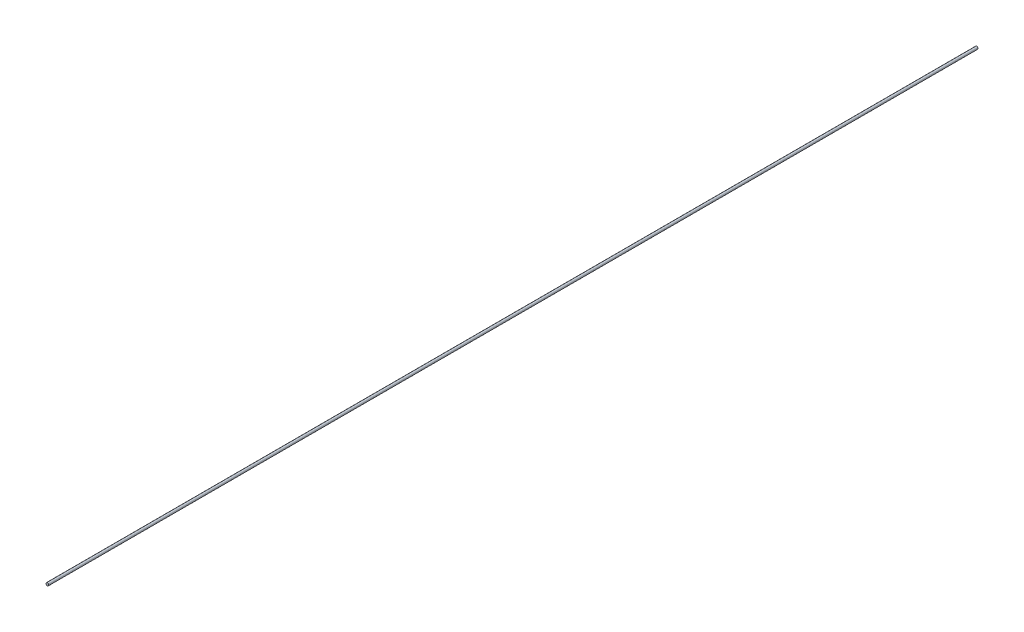
ISO-10303-21;
HEADER;
FILE_DESCRIPTION(('STEP AP214'),'2;1');
FILE_NAME('part.step','',(''),(''),'','','');
FILE_SCHEMA(('AUTOMOTIVE_DESIGN { 1 0 10303 214 1 1 1 1 }'));
ENDSEC;
DATA;
#1=APPLICATION_CONTEXT('core data for automotive mechanical design processes');
#2=APPLICATION_PROTOCOL_DEFINITION('international standard','automotive_design',2000,#1);
#3=PRODUCT_CONTEXT('',#1,'mechanical');
#4=PRODUCT('Part','Part','',(#3));
#5=PRODUCT_RELATED_PRODUCT_CATEGORY('part','',(#4));
#6=PRODUCT_DEFINITION_FORMATION('','',#4);
#7=PRODUCT_DEFINITION_CONTEXT('part definition',#1,'design');
#8=PRODUCT_DEFINITION('design','',#6,#7);
#9=PRODUCT_DEFINITION_SHAPE('','',#8);
#10=(LENGTH_UNIT() NAMED_UNIT(*) SI_UNIT(.MILLI.,.METRE.));
#11=(NAMED_UNIT(*) PLANE_ANGLE_UNIT() SI_UNIT($,.RADIAN.));
#12=(NAMED_UNIT(*) SI_UNIT($,.STERADIAN.) SOLID_ANGLE_UNIT());
#13=UNCERTAINTY_MEASURE_WITH_UNIT(LENGTH_MEASURE(1.E-05),#10,'distance_accuracy_value','');
#14=(GEOMETRIC_REPRESENTATION_CONTEXT(3) GLOBAL_UNCERTAINTY_ASSIGNED_CONTEXT((#13)) GLOBAL_UNIT_ASSIGNED_CONTEXT((#10,
#11,#12)) REPRESENTATION_CONTEXT('',''));
#15=CARTESIAN_POINT('',(0.,0.,0.));
#16=DIRECTION('',(0.,0.,1.));
#17=DIRECTION('',(1.,0.,0.));
#18=AXIS2_PLACEMENT_3D('',#15,#16,#17);
#19=CARTESIAN_POINT('',(0.,0.,700.));
#20=DIRECTION('',(0.,0.,-1.));
#21=DIRECTION('',(-1.,0.,0.));
#22=AXIS2_PLACEMENT_3D('',#19,#20,#21);
#23=CYLINDRICAL_SURFACE('',#22,1.);
#24=CARTESIAN_POINT('',(0.,0.,700.));
#25=DIRECTION('',(0.,0.,1.));
#26=DIRECTION('',(1.,0.,0.));
#27=AXIS2_PLACEMENT_3D('',#24,#25,#26);
#28=CIRCLE('',#27,1.);
#29=CARTESIAN_POINT('',(1.,0.,700.));
#30=VERTEX_POINT('',#29);
#31=EDGE_CURVE('E10',#30,#30,#28,.T.);
#32=ORIENTED_EDGE('',*,*,#31,.F.);
#33=EDGE_LOOP('',(#32));
#34=FACE_BOUND('',#33,.T.);
#35=CARTESIAN_POINT('',(0.,0.,0.));
#36=DIRECTION('',(0.,0.,1.));
#37=DIRECTION('',(1.,0.,0.));
#38=AXIS2_PLACEMENT_3D('',#35,#36,#37);
#39=CIRCLE('',#38,1.);
#40=CARTESIAN_POINT('',(1.,0.,0.));
#41=VERTEX_POINT('',#40);
#42=EDGE_CURVE('E35',#41,#41,#39,.T.);
#43=ORIENTED_EDGE('',*,*,#42,.T.);
#44=EDGE_LOOP('',(#43));
#45=FACE_BOUND('',#44,.T.);
#46=ADVANCED_FACE('F32',(#34,#45),#23,.T.);
#47=CARTESIAN_POINT('',(0.,0.,700.));
#48=DIRECTION('',(0.,0.,1.));
#49=DIRECTION('',(1.,0.,0.));
#50=AXIS2_PLACEMENT_3D('',#47,#48,#49);
#51=PLANE('',#50);
#52=ORIENTED_EDGE('',*,*,#31,.T.);
#53=EDGE_LOOP('',(#52));
#54=FACE_BOUND('',#53,.T.);
#55=ADVANCED_FACE('F47',(#54),#51,.T.);
#56=CARTESIAN_POINT('',(0.,0.,0.));
#57=DIRECTION('',(0.,0.,1.));
#58=DIRECTION('',(1.,0.,0.));
#59=AXIS2_PLACEMENT_3D('',#56,#57,#58);
#60=PLANE('',#59);
#61=ORIENTED_EDGE('',*,*,#42,.F.);
#62=EDGE_LOOP('',(#61));
#63=FACE_BOUND('',#62,.T.);
#64=ADVANCED_FACE('F45',(#63),#60,.F.);
#65=CLOSED_SHELL('',(#46,#55,#64));
#66=MANIFOLD_SOLID_BREP('B2',#65);
#67=ADVANCED_BREP_SHAPE_REPRESENTATION('',(#18,#66),#14);
#68=SHAPE_DEFINITION_REPRESENTATION(#9,#67);
ENDSEC;
END-ISO-10303-21;
